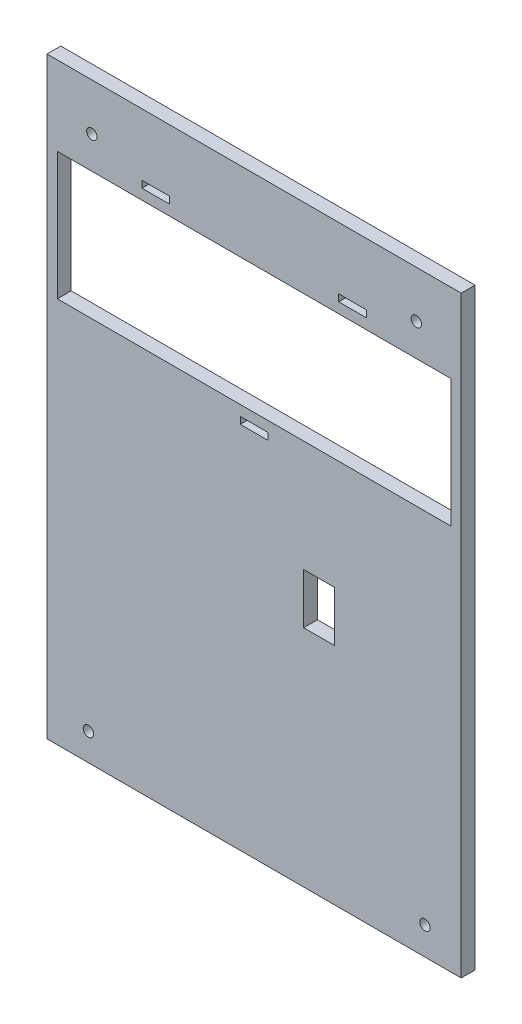
ISO-10303-21;
HEADER;
FILE_DESCRIPTION(('STEP AP214'),'2;1');
FILE_NAME('part.step','',(''),(''),'','','');
FILE_SCHEMA(('AUTOMOTIVE_DESIGN { 1 0 10303 214 1 1 1 1 }'));
ENDSEC;
DATA;
#1=APPLICATION_CONTEXT('core data for automotive mechanical design processes');
#2=APPLICATION_PROTOCOL_DEFINITION('international standard','automotive_design',2000,#1);
#3=PRODUCT_CONTEXT('',#1,'mechanical');
#4=PRODUCT('Part','Part','',(#3));
#5=PRODUCT_RELATED_PRODUCT_CATEGORY('part','',(#4));
#6=PRODUCT_DEFINITION_FORMATION('','',#4);
#7=PRODUCT_DEFINITION_CONTEXT('part definition',#1,'design');
#8=PRODUCT_DEFINITION('design','',#6,#7);
#9=PRODUCT_DEFINITION_SHAPE('','',#8);
#10=(LENGTH_UNIT() NAMED_UNIT(*) SI_UNIT(.MILLI.,.METRE.));
#11=(NAMED_UNIT(*) PLANE_ANGLE_UNIT() SI_UNIT($,.RADIAN.));
#12=(NAMED_UNIT(*) SI_UNIT($,.STERADIAN.) SOLID_ANGLE_UNIT());
#13=UNCERTAINTY_MEASURE_WITH_UNIT(LENGTH_MEASURE(1.E-05),#10,'distance_accuracy_value','');
#14=(GEOMETRIC_REPRESENTATION_CONTEXT(3) GLOBAL_UNCERTAINTY_ASSIGNED_CONTEXT((#13)) GLOBAL_UNIT_ASSIGNED_CONTEXT((#10,
#11,#12)) REPRESENTATION_CONTEXT('',''));
#15=CARTESIAN_POINT('',(0.,0.,0.));
#16=DIRECTION('',(0.,0.,1.));
#17=DIRECTION('',(1.,0.,0.));
#18=AXIS2_PLACEMENT_3D('',#15,#16,#17);
#19=CARTESIAN_POINT('',(0.,0.,4.));
#20=DIRECTION('',(0.,0.,-1.));
#21=DIRECTION('',(-1.,0.,0.));
#22=AXIS2_PLACEMENT_3D('',#19,#20,#21);
#23=PLANE('',#22);
#24=DIRECTION('',(1.,0.,0.));
#25=VECTOR('',#24,1.);
#26=CARTESIAN_POINT('',(74.3565857137862,71.7261271974463,4.));
#27=LINE('',#26,#25);
#28=CARTESIAN_POINT('',(74.3565857137862,71.7261271974463,4.));
#29=VERTEX_POINT('',#28);
#30=CARTESIAN_POINT('',(83.3565857137861,71.7261271974463,4.));
#31=VERTEX_POINT('',#30);
#32=EDGE_CURVE('E362',#29,#31,#27,.T.);
#33=ORIENTED_EDGE('',*,*,#32,.T.);
#34=DIRECTION('',(0.,-1.,0.));
#35=VECTOR('',#34,1.);
#36=CARTESIAN_POINT('',(83.3565857137861,57.1261271974464,4.));
#37=LINE('',#36,#35);
#38=CARTESIAN_POINT('',(83.3565857137861,57.1261271974464,4.));
#39=VERTEX_POINT('',#38);
#40=EDGE_CURVE('E356',#31,#39,#37,.T.);
#41=ORIENTED_EDGE('',*,*,#40,.T.);
#42=DIRECTION('',(-1.,0.,0.));
#43=VECTOR('',#42,1.);
#44=CARTESIAN_POINT('',(74.3565857137862,57.1261271974464,4.));
#45=LINE('',#44,#43);
#46=CARTESIAN_POINT('',(74.3565857137862,57.1261271974464,4.));
#47=VERTEX_POINT('',#46);
#48=EDGE_CURVE('E365',#39,#47,#45,.T.);
#49=ORIENTED_EDGE('',*,*,#48,.T.);
#50=DIRECTION('',(0.,1.,0.));
#51=VECTOR('',#50,1.);
#52=CARTESIAN_POINT('',(74.3565857137862,57.1261271974464,4.));
#53=LINE('',#52,#51);
#54=EDGE_CURVE('E209',#47,#29,#53,.T.);
#55=ORIENTED_EDGE('',*,*,#54,.T.);
#56=EDGE_LOOP('',(#33,#41,#49,#55));
#57=FACE_BOUND('',#56,.T.);
#58=DIRECTION('',(-1.,0.,0.));
#59=VECTOR('',#58,1.);
#60=CARTESIAN_POINT('',(64.,98.97,4.));
#61=LINE('',#60,#59);
#62=CARTESIAN_POINT('',(64.,98.97,4.));
#63=VERTEX_POINT('',#62);
#64=CARTESIAN_POINT('',(56.,98.97,4.));
#65=VERTEX_POINT('',#64);
#66=EDGE_CURVE('E400',#63,#65,#61,.T.);
#67=ORIENTED_EDGE('',*,*,#66,.T.);
#68=DIRECTION('',(0.,1.,0.));
#69=VECTOR('',#68,1.);
#70=CARTESIAN_POINT('',(56.,98.97,4.));
#71=LINE('',#70,#69);
#72=CARTESIAN_POINT('',(56.,100.97,4.));
#73=VERTEX_POINT('',#72);
#74=EDGE_CURVE('E390',#65,#73,#71,.T.);
#75=ORIENTED_EDGE('',*,*,#74,.T.);
#76=DIRECTION('',(1.,0.,0.));
#77=VECTOR('',#76,1.);
#78=CARTESIAN_POINT('',(56.,100.97,4.));
#79=LINE('',#78,#77);
#80=CARTESIAN_POINT('',(64.,100.97,4.));
#81=VERTEX_POINT('',#80);
#82=EDGE_CURVE('E393',#73,#81,#79,.T.);
#83=ORIENTED_EDGE('',*,*,#82,.T.);
#84=DIRECTION('',(0.,-1.,0.));
#85=VECTOR('',#84,1.);
#86=CARTESIAN_POINT('',(64.,100.97,4.));
#87=LINE('',#86,#85);
#88=EDGE_CURVE('E397',#81,#63,#87,.T.);
#89=ORIENTED_EDGE('',*,*,#88,.T.);
#90=EDGE_LOOP('',(#67,#75,#83,#89));
#91=FACE_BOUND('',#90,.T.);
#92=CARTESIAN_POINT('',(12.,0.,4.));
#93=DIRECTION('',(0.,0.,1.));
#94=DIRECTION('',(1.,0.,0.));
#95=AXIS2_PLACEMENT_3D('',#92,#93,#94);
#96=CIRCLE('',#95,1.5);
#97=CARTESIAN_POINT('',(13.5,0.,4.));
#98=VERTEX_POINT('',#97);
#99=EDGE_CURVE('E485',#98,#98,#96,.T.);
#100=ORIENTED_EDGE('',*,*,#99,.F.);
#101=EDGE_LOOP('',(#100));
#102=FACE_BOUND('',#101,.T.);
#103=CARTESIAN_POINT('',(109.5,0.156854249492381,4.));
#104=DIRECTION('',(0.,0.,1.));
#105=DIRECTION('',(1.,0.,0.));
#106=AXIS2_PLACEMENT_3D('',#103,#104,#105);
#107=CIRCLE('',#106,1.5);
#108=CARTESIAN_POINT('',(111.,0.156854249492381,4.));
#109=VERTEX_POINT('',#108);
#110=EDGE_CURVE('E491',#109,#109,#107,.T.);
#111=ORIENTED_EDGE('',*,*,#110,.F.);
#112=EDGE_LOOP('',(#111));
#113=FACE_BOUND('',#112,.T.);
#114=CARTESIAN_POINT('',(107.,150.313145750508,4.));
#115=DIRECTION('',(0.,0.,1.));
#116=DIRECTION('',(1.,0.,0.));
#117=AXIS2_PLACEMENT_3D('',#114,#115,#116);
#118=CIRCLE('',#117,1.50000000000001);
#119=CARTESIAN_POINT('',(108.5,150.313145750508,4.));
#120=VERTEX_POINT('',#119);
#121=EDGE_CURVE('E497',#120,#120,#118,.T.);
#122=ORIENTED_EDGE('',*,*,#121,.F.);
#123=EDGE_LOOP('',(#122));
#124=FACE_BOUND('',#123,.T.);
#125=CARTESIAN_POINT('',(13.,150.313145750508,4.));
#126=DIRECTION('',(0.,0.,1.));
#127=DIRECTION('',(1.,0.,0.));
#128=AXIS2_PLACEMENT_3D('',#125,#126,#127);
#129=CIRCLE('',#128,1.5);
#130=CARTESIAN_POINT('',(14.5,150.313145750508,4.));
#131=VERTEX_POINT('',#130);
#132=EDGE_CURVE('E503',#131,#131,#129,.T.);
#133=ORIENTED_EDGE('',*,*,#132,.F.);
#134=EDGE_LOOP('',(#133));
#135=FACE_BOUND('',#134,.T.);
#136=DIRECTION('',(0.,-1.,0.));
#137=VECTOR('',#136,1.);
#138=CARTESIAN_POINT('',(3.,0.,4.));
#139=LINE('',#138,#137);
#140=CARTESIAN_POINT('',(3.,140.97,4.));
#141=VERTEX_POINT('',#140);
#142=CARTESIAN_POINT('',(3.,103.97,4.));
#143=VERTEX_POINT('',#142);
#144=EDGE_CURVE('E509',#141,#143,#139,.T.);
#145=ORIENTED_EDGE('',*,*,#144,.F.);
#146=DIRECTION('',(1.,0.,0.));
#147=VECTOR('',#146,1.);
#148=CARTESIAN_POINT('',(0.,140.97,4.));
#149=LINE('',#148,#147);
#150=CARTESIAN_POINT('',(117.,140.97,4.));
#151=VERTEX_POINT('',#150);
#152=EDGE_CURVE('E517',#141,#151,#149,.T.);
#153=ORIENTED_EDGE('',*,*,#152,.T.);
#154=DIRECTION('',(0.,-1.,0.));
#155=VECTOR('',#154,1.);
#156=CARTESIAN_POINT('',(117.,0.,4.));
#157=LINE('',#156,#155);
#158=CARTESIAN_POINT('',(117.,103.97,4.));
#159=VERTEX_POINT('',#158);
#160=EDGE_CURVE('E514',#151,#159,#157,.T.);
#161=ORIENTED_EDGE('',*,*,#160,.T.);
#162=DIRECTION('',(1.,0.,0.));
#163=VECTOR('',#162,1.);
#164=CARTESIAN_POINT('',(0.,103.97,4.));
#165=LINE('',#164,#163);
#166=EDGE_CURVE('E511',#143,#159,#165,.T.);
#167=ORIENTED_EDGE('',*,*,#166,.F.);
#168=EDGE_LOOP('',(#145,#153,#161,#167));
#169=FACE_BOUND('',#168,.T.);
#170=DIRECTION('',(0.,1.,0.));
#171=VECTOR('',#170,1.);
#172=CARTESIAN_POINT('',(0.,-7.92893218813452,4.));
#173=LINE('',#172,#171);
#174=CARTESIAN_POINT('',(0.,-7.92893218813452,4.));
#175=VERTEX_POINT('',#174);
#176=CARTESIAN_POINT('',(0.,163.898932188134,4.));
#177=VERTEX_POINT('',#176);
#178=EDGE_CURVE('E541',#175,#177,#173,.T.);
#179=ORIENTED_EDGE('',*,*,#178,.F.);
#180=DIRECTION('',(-1.,0.,0.));
#181=VECTOR('',#180,1.);
#182=CARTESIAN_POINT('',(120.,-7.92893218813451,4.));
#183=LINE('',#182,#181);
#184=CARTESIAN_POINT('',(120.,-7.92893218813451,4.));
#185=VERTEX_POINT('',#184);
#186=EDGE_CURVE('E551',#185,#175,#183,.T.);
#187=ORIENTED_EDGE('',*,*,#186,.F.);
#188=DIRECTION('',(0.,-1.,0.));
#189=VECTOR('',#188,1.);
#190=CARTESIAN_POINT('',(120.,163.898932188134,4.));
#191=LINE('',#190,#189);
#192=CARTESIAN_POINT('',(120.,163.898932188134,4.));
#193=VERTEX_POINT('',#192);
#194=EDGE_CURVE('E548',#193,#185,#191,.T.);
#195=ORIENTED_EDGE('',*,*,#194,.F.);
#196=DIRECTION('',(1.,0.,0.));
#197=VECTOR('',#196,1.);
#198=CARTESIAN_POINT('',(0.,163.898932188134,4.));
#199=LINE('',#198,#197);
#200=EDGE_CURVE('E544',#177,#193,#199,.T.);
#201=ORIENTED_EDGE('',*,*,#200,.F.);
#202=EDGE_LOOP('',(#179,#187,#195,#201));
#203=FACE_BOUND('',#202,.T.);
#204=DIRECTION('',(0.,-1.,0.));
#205=VECTOR('',#204,1.);
#206=CARTESIAN_POINT('',(35.5,0.,4.));
#207=LINE('',#206,#205);
#208=CARTESIAN_POINT('',(35.5,145.97,4.));
#209=VERTEX_POINT('',#208);
#210=CARTESIAN_POINT('',(35.5,143.97,4.));
#211=VERTEX_POINT('',#210);
#212=EDGE_CURVE('E456',#209,#211,#207,.T.);
#213=ORIENTED_EDGE('',*,*,#212,.T.);
#214=DIRECTION('',(-1.,0.,0.));
#215=VECTOR('',#214,1.);
#216=CARTESIAN_POINT('',(0.,143.97,4.));
#217=LINE('',#216,#215);
#218=CARTESIAN_POINT('',(27.5,143.97,4.));
#219=VERTEX_POINT('',#218);
#220=EDGE_CURVE('E453',#211,#219,#217,.T.);
#221=ORIENTED_EDGE('',*,*,#220,.T.);
#222=DIRECTION('',(0.,1.,0.));
#223=VECTOR('',#222,1.);
#224=CARTESIAN_POINT('',(27.5,0.,4.));
#225=LINE('',#224,#223);
#226=CARTESIAN_POINT('',(27.5,145.97,4.));
#227=VERTEX_POINT('',#226);
#228=EDGE_CURVE('E463',#219,#227,#225,.T.);
#229=ORIENTED_EDGE('',*,*,#228,.T.);
#230=DIRECTION('',(1.,0.,0.));
#231=VECTOR('',#230,1.);
#232=CARTESIAN_POINT('',(0.,145.97,4.));
#233=LINE('',#232,#231);
#234=EDGE_CURVE('E460',#227,#209,#233,.T.);
#235=ORIENTED_EDGE('',*,*,#234,.T.);
#236=EDGE_LOOP('',(#213,#221,#229,#235));
#237=FACE_BOUND('',#236,.T.);
#238=DIRECTION('',(0.,-1.,0.));
#239=VECTOR('',#238,1.);
#240=CARTESIAN_POINT('',(84.5,0.,4.));
#241=LINE('',#240,#239);
#242=CARTESIAN_POINT('',(84.5,145.97,4.));
#243=VERTEX_POINT('',#242);
#244=CARTESIAN_POINT('',(84.5,143.97,4.));
#245=VERTEX_POINT('',#244);
#246=EDGE_CURVE('E422',#243,#245,#241,.T.);
#247=ORIENTED_EDGE('',*,*,#246,.F.);
#248=DIRECTION('',(-1.,0.,0.));
#249=VECTOR('',#248,1.);
#250=CARTESIAN_POINT('',(0.,145.97,4.));
#251=LINE('',#250,#249);
#252=CARTESIAN_POINT('',(92.5,145.97,4.));
#253=VERTEX_POINT('',#252);
#254=EDGE_CURVE('E430',#253,#243,#251,.T.);
#255=ORIENTED_EDGE('',*,*,#254,.F.);
#256=DIRECTION('',(0.,1.,0.));
#257=VECTOR('',#256,1.);
#258=CARTESIAN_POINT('',(92.5,0.,4.));
#259=LINE('',#258,#257);
#260=CARTESIAN_POINT('',(92.5,143.97,4.));
#261=VERTEX_POINT('',#260);
#262=EDGE_CURVE('E427',#261,#253,#259,.T.);
#263=ORIENTED_EDGE('',*,*,#262,.F.);
#264=DIRECTION('',(1.,0.,0.));
#265=VECTOR('',#264,1.);
#266=CARTESIAN_POINT('',(0.,143.97,4.));
#267=LINE('',#266,#265);
#268=EDGE_CURVE('E424',#245,#261,#267,.T.);
#269=ORIENTED_EDGE('',*,*,#268,.F.);
#270=EDGE_LOOP('',(#247,#255,#263,#269));
#271=FACE_BOUND('',#270,.T.);
#272=ADVANCED_FACE('F192',(#57,#91,#102,#113,#124,#135,#169,#203,#237,#271),#23,.F.);
#273=CARTESIAN_POINT('',(0.,0.,0.));
#274=DIRECTION('',(0.,0.,-1.));
#275=DIRECTION('',(-1.,0.,0.));
#276=AXIS2_PLACEMENT_3D('',#273,#274,#275);
#277=PLANE('',#276);
#278=DIRECTION('',(0.,-1.,0.));
#279=VECTOR('',#278,1.);
#280=CARTESIAN_POINT('',(83.3565857137861,57.1261271974464,0.));
#281=LINE('',#280,#279);
#282=CARTESIAN_POINT('',(83.3565857137861,71.7261271974463,0.));
#283=VERTEX_POINT('',#282);
#284=CARTESIAN_POINT('',(83.3565857137861,57.1261271974464,0.));
#285=VERTEX_POINT('',#284);
#286=EDGE_CURVE('E217',#283,#285,#281,.T.);
#287=ORIENTED_EDGE('',*,*,#286,.F.);
#288=DIRECTION('',(1.,0.,0.));
#289=VECTOR('',#288,1.);
#290=CARTESIAN_POINT('',(74.3565857137862,71.7261271974463,0.));
#291=LINE('',#290,#289);
#292=CARTESIAN_POINT('',(74.3565857137862,71.7261271974463,0.));
#293=VERTEX_POINT('',#292);
#294=EDGE_CURVE('E371',#293,#283,#291,.T.);
#295=ORIENTED_EDGE('',*,*,#294,.F.);
#296=DIRECTION('',(0.,1.,0.));
#297=VECTOR('',#296,1.);
#298=CARTESIAN_POINT('',(74.3565857137862,57.1261271974464,0.));
#299=LINE('',#298,#297);
#300=CARTESIAN_POINT('',(74.3565857137862,57.1261271974464,0.));
#301=VERTEX_POINT('',#300);
#302=EDGE_CURVE('E374',#301,#293,#299,.T.);
#303=ORIENTED_EDGE('',*,*,#302,.F.);
#304=DIRECTION('',(-1.,0.,0.));
#305=VECTOR('',#304,1.);
#306=CARTESIAN_POINT('',(74.3565857137862,57.1261271974464,0.));
#307=LINE('',#306,#305);
#308=EDGE_CURVE('E380',#285,#301,#307,.T.);
#309=ORIENTED_EDGE('',*,*,#308,.F.);
#310=EDGE_LOOP('',(#287,#295,#303,#309));
#311=FACE_BOUND('',#310,.T.);
#312=DIRECTION('',(0.,1.,0.));
#313=VECTOR('',#312,1.);
#314=CARTESIAN_POINT('',(56.,98.97,0.));
#315=LINE('',#314,#313);
#316=CARTESIAN_POINT('',(56.,98.97,0.));
#317=VERTEX_POINT('',#316);
#318=CARTESIAN_POINT('',(56.,100.97,0.));
#319=VERTEX_POINT('',#318);
#320=EDGE_CURVE('E386',#317,#319,#315,.T.);
#321=ORIENTED_EDGE('',*,*,#320,.F.);
#322=DIRECTION('',(-1.,0.,0.));
#323=VECTOR('',#322,1.);
#324=CARTESIAN_POINT('',(60.,98.97,0.));
#325=LINE('',#324,#323);
#326=CARTESIAN_POINT('',(64.,98.97,0.));
#327=VERTEX_POINT('',#326);
#328=EDGE_CURVE('E394',#327,#317,#325,.T.);
#329=ORIENTED_EDGE('',*,*,#328,.F.);
#330=DIRECTION('',(0.,-1.,0.));
#331=VECTOR('',#330,1.);
#332=CARTESIAN_POINT('',(64.,100.97,0.));
#333=LINE('',#332,#331);
#334=CARTESIAN_POINT('',(64.,100.97,0.));
#335=VERTEX_POINT('',#334);
#336=EDGE_CURVE('E408',#335,#327,#333,.T.);
#337=ORIENTED_EDGE('',*,*,#336,.F.);
#338=DIRECTION('',(1.,0.,0.));
#339=VECTOR('',#338,1.);
#340=CARTESIAN_POINT('',(56.,100.97,0.));
#341=LINE('',#340,#339);
#342=EDGE_CURVE('E405',#319,#335,#341,.T.);
#343=ORIENTED_EDGE('',*,*,#342,.F.);
#344=EDGE_LOOP('',(#321,#329,#337,#343));
#345=FACE_BOUND('',#344,.T.);
#346=DIRECTION('',(-1.,0.,0.));
#347=VECTOR('',#346,1.);
#348=CARTESIAN_POINT('',(0.,143.97,0.));
#349=LINE('',#348,#347);
#350=CARTESIAN_POINT('',(35.5,143.97,0.));
#351=VERTEX_POINT('',#350);
#352=CARTESIAN_POINT('',(27.5,143.97,0.));
#353=VERTEX_POINT('',#352);
#354=EDGE_CURVE('E452',#351,#353,#349,.T.);
#355=ORIENTED_EDGE('',*,*,#354,.F.);
#356=DIRECTION('',(0.,-1.,0.));
#357=VECTOR('',#356,1.);
#358=CARTESIAN_POINT('',(35.5,0.,0.));
#359=LINE('',#358,#357);
#360=CARTESIAN_POINT('',(35.5,145.97,0.));
#361=VERTEX_POINT('',#360);
#362=EDGE_CURVE('E468',#361,#351,#359,.T.);
#363=ORIENTED_EDGE('',*,*,#362,.F.);
#364=DIRECTION('',(1.,0.,0.));
#365=VECTOR('',#364,1.);
#366=CARTESIAN_POINT('',(0.,145.97,0.));
#367=LINE('',#366,#365);
#368=CARTESIAN_POINT('',(27.5,145.97,0.));
#369=VERTEX_POINT('',#368);
#370=EDGE_CURVE('E471',#369,#361,#367,.T.);
#371=ORIENTED_EDGE('',*,*,#370,.F.);
#372=DIRECTION('',(0.,1.,0.));
#373=VECTOR('',#372,1.);
#374=CARTESIAN_POINT('',(27.5,0.,0.));
#375=LINE('',#374,#373);
#376=EDGE_CURVE('E457',#353,#369,#375,.T.);
#377=ORIENTED_EDGE('',*,*,#376,.F.);
#378=EDGE_LOOP('',(#355,#363,#371,#377));
#379=FACE_BOUND('',#378,.T.);
#380=CARTESIAN_POINT('',(109.5,0.156854249492381,0.));
#381=DIRECTION('',(0.,0.,1.));
#382=DIRECTION('',(1.,0.,0.));
#383=AXIS2_PLACEMENT_3D('',#380,#381,#382);
#384=CIRCLE('',#383,1.5);
#385=CARTESIAN_POINT('',(111.,0.156854249492381,0.));
#386=VERTEX_POINT('',#385);
#387=EDGE_CURVE('E488',#386,#386,#384,.T.);
#388=ORIENTED_EDGE('',*,*,#387,.T.);
#389=EDGE_LOOP('',(#388));
#390=FACE_BOUND('',#389,.T.);
#391=CARTESIAN_POINT('',(13.,150.313145750508,0.));
#392=DIRECTION('',(0.,0.,1.));
#393=DIRECTION('',(1.,0.,0.));
#394=AXIS2_PLACEMENT_3D('',#391,#392,#393);
#395=CIRCLE('',#394,1.5);
#396=CARTESIAN_POINT('',(14.5,150.313145750508,0.));
#397=VERTEX_POINT('',#396);
#398=EDGE_CURVE('E500',#397,#397,#395,.T.);
#399=ORIENTED_EDGE('',*,*,#398,.T.);
#400=EDGE_LOOP('',(#399));
#401=FACE_BOUND('',#400,.T.);
#402=DIRECTION('',(0.,1.,0.));
#403=VECTOR('',#402,1.);
#404=CARTESIAN_POINT('',(0.,-7.92893218813452,0.));
#405=LINE('',#404,#403);
#406=CARTESIAN_POINT('',(0.,-7.92893218813452,0.));
#407=VERTEX_POINT('',#406);
#408=CARTESIAN_POINT('',(0.,163.898932188134,0.));
#409=VERTEX_POINT('',#408);
#410=EDGE_CURVE('E540',#407,#409,#405,.T.);
#411=ORIENTED_EDGE('',*,*,#410,.T.);
#412=DIRECTION('',(1.,0.,0.));
#413=VECTOR('',#412,1.);
#414=CARTESIAN_POINT('',(0.,163.898932188134,0.));
#415=LINE('',#414,#413);
#416=CARTESIAN_POINT('',(120.,163.898932188134,0.));
#417=VERTEX_POINT('',#416);
#418=EDGE_CURVE('E556',#409,#417,#415,.T.);
#419=ORIENTED_EDGE('',*,*,#418,.T.);
#420=DIRECTION('',(0.,-1.,0.));
#421=VECTOR('',#420,1.);
#422=CARTESIAN_POINT('',(120.,163.898932188134,0.));
#423=LINE('',#422,#421);
#424=CARTESIAN_POINT('',(120.,-7.92893218813451,0.));
#425=VERTEX_POINT('',#424);
#426=EDGE_CURVE('E559',#417,#425,#423,.T.);
#427=ORIENTED_EDGE('',*,*,#426,.T.);
#428=DIRECTION('',(-1.,0.,0.));
#429=VECTOR('',#428,1.);
#430=CARTESIAN_POINT('',(120.,-7.92893218813451,0.));
#431=LINE('',#430,#429);
#432=EDGE_CURVE('E545',#425,#407,#431,.T.);
#433=ORIENTED_EDGE('',*,*,#432,.T.);
#434=EDGE_LOOP('',(#411,#419,#427,#433));
#435=FACE_BOUND('',#434,.T.);
#436=DIRECTION('',(1.,0.,0.));
#437=VECTOR('',#436,1.);
#438=CARTESIAN_POINT('',(0.,140.97,0.));
#439=LINE('',#438,#437);
#440=CARTESIAN_POINT('',(3.,140.97,0.));
#441=VERTEX_POINT('',#440);
#442=CARTESIAN_POINT('',(117.,140.97,0.));
#443=VERTEX_POINT('',#442);
#444=EDGE_CURVE('E512',#441,#443,#439,.T.);
#445=ORIENTED_EDGE('',*,*,#444,.F.);
#446=DIRECTION('',(0.,-1.,0.));
#447=VECTOR('',#446,1.);
#448=CARTESIAN_POINT('',(3.,0.,0.));
#449=LINE('',#448,#447);
#450=CARTESIAN_POINT('',(3.,103.97,0.));
#451=VERTEX_POINT('',#450);
#452=EDGE_CURVE('E506',#441,#451,#449,.T.);
#453=ORIENTED_EDGE('',*,*,#452,.T.);
#454=DIRECTION('',(1.,0.,0.));
#455=VECTOR('',#454,1.);
#456=CARTESIAN_POINT('',(0.,103.97,0.));
#457=LINE('',#456,#455);
#458=CARTESIAN_POINT('',(117.,103.97,0.));
#459=VERTEX_POINT('',#458);
#460=EDGE_CURVE('E523',#451,#459,#457,.T.);
#461=ORIENTED_EDGE('',*,*,#460,.T.);
#462=DIRECTION('',(0.,-1.,0.));
#463=VECTOR('',#462,1.);
#464=CARTESIAN_POINT('',(117.,0.,0.));
#465=LINE('',#464,#463);
#466=EDGE_CURVE('E526',#443,#459,#465,.T.);
#467=ORIENTED_EDGE('',*,*,#466,.F.);
#468=EDGE_LOOP('',(#445,#453,#461,#467));
#469=FACE_BOUND('',#468,.T.);
#470=CARTESIAN_POINT('',(107.,150.313145750508,0.));
#471=DIRECTION('',(0.,0.,1.));
#472=DIRECTION('',(1.,0.,0.));
#473=AXIS2_PLACEMENT_3D('',#470,#471,#472);
#474=CIRCLE('',#473,1.50000000000001);
#475=CARTESIAN_POINT('',(108.5,150.313145750508,0.));
#476=VERTEX_POINT('',#475);
#477=EDGE_CURVE('E494',#476,#476,#474,.T.);
#478=ORIENTED_EDGE('',*,*,#477,.T.);
#479=EDGE_LOOP('',(#478));
#480=FACE_BOUND('',#479,.T.);
#481=CARTESIAN_POINT('',(12.,0.,0.));
#482=DIRECTION('',(0.,0.,1.));
#483=DIRECTION('',(1.,0.,0.));
#484=AXIS2_PLACEMENT_3D('',#481,#482,#483);
#485=CIRCLE('',#484,1.5);
#486=CARTESIAN_POINT('',(13.5,0.,0.));
#487=VERTEX_POINT('',#486);
#488=EDGE_CURVE('E484',#487,#487,#485,.T.);
#489=ORIENTED_EDGE('',*,*,#488,.T.);
#490=EDGE_LOOP('',(#489));
#491=FACE_BOUND('',#490,.T.);
#492=DIRECTION('',(-1.,0.,0.));
#493=VECTOR('',#492,1.);
#494=CARTESIAN_POINT('',(0.,145.97,0.));
#495=LINE('',#494,#493);
#496=CARTESIAN_POINT('',(92.5,145.97,0.));
#497=VERTEX_POINT('',#496);
#498=CARTESIAN_POINT('',(84.5,145.97,0.));
#499=VERTEX_POINT('',#498);
#500=EDGE_CURVE('E425',#497,#499,#495,.T.);
#501=ORIENTED_EDGE('',*,*,#500,.T.);
#502=DIRECTION('',(0.,-1.,0.));
#503=VECTOR('',#502,1.);
#504=CARTESIAN_POINT('',(84.5,0.,0.));
#505=LINE('',#504,#503);
#506=CARTESIAN_POINT('',(84.5,143.97,0.));
#507=VERTEX_POINT('',#506);
#508=EDGE_CURVE('E415',#499,#507,#505,.T.);
#509=ORIENTED_EDGE('',*,*,#508,.T.);
#510=DIRECTION('',(1.,0.,0.));
#511=VECTOR('',#510,1.);
#512=CARTESIAN_POINT('',(0.,143.97,0.));
#513=LINE('',#512,#511);
#514=CARTESIAN_POINT('',(92.5,143.97,0.));
#515=VERTEX_POINT('',#514);
#516=EDGE_CURVE('E435',#507,#515,#513,.T.);
#517=ORIENTED_EDGE('',*,*,#516,.T.);
#518=DIRECTION('',(0.,1.,0.));
#519=VECTOR('',#518,1.);
#520=CARTESIAN_POINT('',(92.5,0.,0.));
#521=LINE('',#520,#519);
#522=EDGE_CURVE('E438',#515,#497,#521,.T.);
#523=ORIENTED_EDGE('',*,*,#522,.T.);
#524=EDGE_LOOP('',(#501,#509,#517,#523));
#525=FACE_BOUND('',#524,.T.);
#526=ADVANCED_FACE('F574',(#311,#345,#379,#390,#401,#435,#469,#480,#491,#525),#277,.T.);
#527=CARTESIAN_POINT('',(0.,-7.92893218813452,4.));
#528=DIRECTION('',(-1.,0.,0.));
#529=DIRECTION('',(0.,0.,1.));
#530=AXIS2_PLACEMENT_3D('',#527,#528,#529);
#531=PLANE('',#530);
#532=ORIENTED_EDGE('',*,*,#410,.F.);
#533=DIRECTION('',(0.,0.,-1.));
#534=VECTOR('',#533,1.);
#535=CARTESIAN_POINT('',(0.,-7.92893218813452,4.));
#536=LINE('',#535,#534);
#537=EDGE_CURVE('E12',#175,#407,#536,.T.);
#538=ORIENTED_EDGE('',*,*,#537,.F.);
#539=ORIENTED_EDGE('',*,*,#178,.T.);
#540=DIRECTION('',(0.,0.,-1.));
#541=VECTOR('',#540,1.);
#542=CARTESIAN_POINT('',(0.,163.898932188134,4.));
#543=LINE('',#542,#541);
#544=EDGE_CURVE('E196',#177,#409,#543,.T.);
#545=ORIENTED_EDGE('',*,*,#544,.T.);
#546=EDGE_LOOP('',(#532,#538,#539,#545));
#547=FACE_BOUND('',#546,.T.);
#548=ADVANCED_FACE('F194',(#547),#531,.T.);
#549=CARTESIAN_POINT('',(120.,-7.92893218813451,4.));
#550=DIRECTION('',(0.,-1.,0.));
#551=DIRECTION('',(1.,0.,0.));
#552=AXIS2_PLACEMENT_3D('',#549,#550,#551);
#553=PLANE('',#552);
#554=ORIENTED_EDGE('',*,*,#432,.F.);
#555=DIRECTION('',(0.,0.,-1.));
#556=VECTOR('',#555,1.);
#557=CARTESIAN_POINT('',(120.,-7.92893218813451,4.));
#558=LINE('',#557,#556);
#559=EDGE_CURVE('E201',#185,#425,#558,.T.);
#560=ORIENTED_EDGE('',*,*,#559,.F.);
#561=ORIENTED_EDGE('',*,*,#186,.T.);
#562=ORIENTED_EDGE('',*,*,#537,.T.);
#563=EDGE_LOOP('',(#554,#560,#561,#562));
#564=FACE_BOUND('',#563,.T.);
#565=ADVANCED_FACE('F578',(#564),#553,.T.);
#566=CARTESIAN_POINT('',(120.,163.898932188134,4.));
#567=DIRECTION('',(1.,0.,0.));
#568=DIRECTION('',(0.,1.,0.));
#569=AXIS2_PLACEMENT_3D('',#566,#567,#568);
#570=PLANE('',#569);
#571=ORIENTED_EDGE('',*,*,#426,.F.);
#572=DIRECTION('',(0.,0.,-1.));
#573=VECTOR('',#572,1.);
#574=CARTESIAN_POINT('',(120.,163.898932188134,4.));
#575=LINE('',#574,#573);
#576=EDGE_CURVE('E564',#193,#417,#575,.T.);
#577=ORIENTED_EDGE('',*,*,#576,.F.);
#578=ORIENTED_EDGE('',*,*,#194,.T.);
#579=ORIENTED_EDGE('',*,*,#559,.T.);
#580=EDGE_LOOP('',(#571,#577,#578,#579));
#581=FACE_BOUND('',#580,.T.);
#582=ADVANCED_FACE('F584',(#581),#570,.T.);
#583=CARTESIAN_POINT('',(0.,163.898932188134,4.));
#584=DIRECTION('',(0.,1.,0.));
#585=DIRECTION('',(0.,0.,1.));
#586=AXIS2_PLACEMENT_3D('',#583,#584,#585);
#587=PLANE('',#586);
#588=ORIENTED_EDGE('',*,*,#418,.F.);
#589=ORIENTED_EDGE('',*,*,#544,.F.);
#590=ORIENTED_EDGE('',*,*,#200,.T.);
#591=ORIENTED_EDGE('',*,*,#576,.T.);
#592=EDGE_LOOP('',(#588,#589,#590,#591));
#593=FACE_BOUND('',#592,.T.);
#594=ADVANCED_FACE('F572',(#593),#587,.T.);
#595=CARTESIAN_POINT('',(3.,0.,4.));
#596=DIRECTION('',(1.,0.,0.));
#597=DIRECTION('',(0.,0.,-1.));
#598=AXIS2_PLACEMENT_3D('',#595,#596,#597);
#599=PLANE('',#598);
#600=ORIENTED_EDGE('',*,*,#452,.F.);
#601=DIRECTION('',(0.,0.,-1.));
#602=VECTOR('',#601,1.);
#603=CARTESIAN_POINT('',(3.,140.97,4.));
#604=LINE('',#603,#602);
#605=EDGE_CURVE('E520',#141,#441,#604,.T.);
#606=ORIENTED_EDGE('',*,*,#605,.F.);
#607=ORIENTED_EDGE('',*,*,#144,.T.);
#608=DIRECTION('',(0.,0.,-1.));
#609=VECTOR('',#608,1.);
#610=CARTESIAN_POINT('',(3.,103.97,4.));
#611=LINE('',#610,#609);
#612=EDGE_CURVE('E537',#143,#451,#611,.T.);
#613=ORIENTED_EDGE('',*,*,#612,.T.);
#614=EDGE_LOOP('',(#600,#606,#607,#613));
#615=FACE_BOUND('',#614,.T.);
#616=ADVANCED_FACE('F591',(#615),#599,.T.);
#617=CARTESIAN_POINT('',(0.,103.97,4.));
#618=DIRECTION('',(0.,1.,0.));
#619=DIRECTION('',(-1.,0.,0.));
#620=AXIS2_PLACEMENT_3D('',#617,#618,#619);
#621=PLANE('',#620);
#622=ORIENTED_EDGE('',*,*,#460,.F.);
#623=ORIENTED_EDGE('',*,*,#612,.F.);
#624=ORIENTED_EDGE('',*,*,#166,.T.);
#625=DIRECTION('',(0.,0.,-1.));
#626=VECTOR('',#625,1.);
#627=CARTESIAN_POINT('',(117.,103.97,4.));
#628=LINE('',#627,#626);
#629=EDGE_CURVE('E535',#159,#459,#628,.T.);
#630=ORIENTED_EDGE('',*,*,#629,.T.);
#631=EDGE_LOOP('',(#622,#623,#624,#630));
#632=FACE_BOUND('',#631,.T.);
#633=ADVANCED_FACE('F603',(#632),#621,.T.);
#634=CARTESIAN_POINT('',(117.,0.,4.));
#635=DIRECTION('',(1.,0.,0.));
#636=DIRECTION('',(0.,0.,-1.));
#637=AXIS2_PLACEMENT_3D('',#634,#635,#636);
#638=PLANE('',#637);
#639=ORIENTED_EDGE('',*,*,#466,.T.);
#640=ORIENTED_EDGE('',*,*,#629,.F.);
#641=ORIENTED_EDGE('',*,*,#160,.F.);
#642=DIRECTION('',(0.,0.,-1.));
#643=VECTOR('',#642,1.);
#644=CARTESIAN_POINT('',(117.,140.97,4.));
#645=LINE('',#644,#643);
#646=EDGE_CURVE('E533',#151,#443,#645,.T.);
#647=ORIENTED_EDGE('',*,*,#646,.T.);
#648=EDGE_LOOP('',(#639,#640,#641,#647));
#649=FACE_BOUND('',#648,.T.);
#650=ADVANCED_FACE('F607',(#649),#638,.F.);
#651=CARTESIAN_POINT('',(0.,140.97,4.));
#652=DIRECTION('',(0.,1.,0.));
#653=DIRECTION('',(0.,0.,1.));
#654=AXIS2_PLACEMENT_3D('',#651,#652,#653);
#655=PLANE('',#654);
#656=ORIENTED_EDGE('',*,*,#444,.T.);
#657=ORIENTED_EDGE('',*,*,#646,.F.);
#658=ORIENTED_EDGE('',*,*,#152,.F.);
#659=ORIENTED_EDGE('',*,*,#605,.T.);
#660=EDGE_LOOP('',(#656,#657,#658,#659));
#661=FACE_BOUND('',#660,.T.);
#662=ADVANCED_FACE('F611',(#661),#655,.F.);
#663=CARTESIAN_POINT('',(13.,150.313145750508,4.));
#664=DIRECTION('',(0.,0.,-1.));
#665=DIRECTION('',(-1.,0.,0.));
#666=AXIS2_PLACEMENT_3D('',#663,#664,#665);
#667=CYLINDRICAL_SURFACE('',#666,1.5);
#668=ORIENTED_EDGE('',*,*,#132,.T.);
#669=EDGE_LOOP('',(#668));
#670=FACE_BOUND('',#669,.T.);
#671=ORIENTED_EDGE('',*,*,#398,.F.);
#672=EDGE_LOOP('',(#671));
#673=FACE_BOUND('',#672,.T.);
#674=ADVANCED_FACE('F615',(#670,#673),#667,.F.);
#675=CARTESIAN_POINT('',(107.,150.313145750508,4.));
#676=DIRECTION('',(0.,0.,-1.));
#677=DIRECTION('',(-1.,0.,0.));
#678=AXIS2_PLACEMENT_3D('',#675,#676,#677);
#679=CYLINDRICAL_SURFACE('',#678,1.50000000000001);
#680=ORIENTED_EDGE('',*,*,#121,.T.);
#681=EDGE_LOOP('',(#680));
#682=FACE_BOUND('',#681,.T.);
#683=ORIENTED_EDGE('',*,*,#477,.F.);
#684=EDGE_LOOP('',(#683));
#685=FACE_BOUND('',#684,.T.);
#686=ADVANCED_FACE('F619',(#682,#685),#679,.F.);
#687=CARTESIAN_POINT('',(109.5,0.156854249492381,4.));
#688=DIRECTION('',(0.,0.,-1.));
#689=DIRECTION('',(-1.,0.,0.));
#690=AXIS2_PLACEMENT_3D('',#687,#688,#689);
#691=CYLINDRICAL_SURFACE('',#690,1.5);
#692=ORIENTED_EDGE('',*,*,#110,.T.);
#693=EDGE_LOOP('',(#692));
#694=FACE_BOUND('',#693,.T.);
#695=ORIENTED_EDGE('',*,*,#387,.F.);
#696=EDGE_LOOP('',(#695));
#697=FACE_BOUND('',#696,.T.);
#698=ADVANCED_FACE('F623',(#694,#697),#691,.F.);
#699=CARTESIAN_POINT('',(12.,0.,4.));
#700=DIRECTION('',(0.,0.,-1.));
#701=DIRECTION('',(-1.,0.,0.));
#702=AXIS2_PLACEMENT_3D('',#699,#700,#701);
#703=CYLINDRICAL_SURFACE('',#702,1.5);
#704=ORIENTED_EDGE('',*,*,#99,.T.);
#705=EDGE_LOOP('',(#704));
#706=FACE_BOUND('',#705,.T.);
#707=ORIENTED_EDGE('',*,*,#488,.F.);
#708=EDGE_LOOP('',(#707));
#709=FACE_BOUND('',#708,.T.);
#710=ADVANCED_FACE('F627',(#706,#709),#703,.F.);
#711=CARTESIAN_POINT('',(0.,143.97,4.));
#712=DIRECTION('',(0.,-1.,0.));
#713=DIRECTION('',(0.,0.,-1.));
#714=AXIS2_PLACEMENT_3D('',#711,#712,#713);
#715=PLANE('',#714);
#716=ORIENTED_EDGE('',*,*,#354,.T.);
#717=DIRECTION('',(0.,0.,-1.));
#718=VECTOR('',#717,1.);
#719=CARTESIAN_POINT('',(27.5,143.97,4.));
#720=LINE('',#719,#718);
#721=EDGE_CURVE('E466',#219,#353,#720,.T.);
#722=ORIENTED_EDGE('',*,*,#721,.F.);
#723=ORIENTED_EDGE('',*,*,#220,.F.);
#724=DIRECTION('',(0.,0.,-1.));
#725=VECTOR('',#724,1.);
#726=CARTESIAN_POINT('',(35.5,143.97,4.));
#727=LINE('',#726,#725);
#728=EDGE_CURVE('E482',#211,#351,#727,.T.);
#729=ORIENTED_EDGE('',*,*,#728,.T.);
#730=EDGE_LOOP('',(#716,#722,#723,#729));
#731=FACE_BOUND('',#730,.T.);
#732=ADVANCED_FACE('F631',(#731),#715,.F.);
#733=CARTESIAN_POINT('',(35.5,0.,4.));
#734=DIRECTION('',(1.,0.,0.));
#735=DIRECTION('',(0.,0.,-1.));
#736=AXIS2_PLACEMENT_3D('',#733,#734,#735);
#737=PLANE('',#736);
#738=ORIENTED_EDGE('',*,*,#362,.T.);
#739=ORIENTED_EDGE('',*,*,#728,.F.);
#740=ORIENTED_EDGE('',*,*,#212,.F.);
#741=DIRECTION('',(0.,0.,-1.));
#742=VECTOR('',#741,1.);
#743=CARTESIAN_POINT('',(35.5,145.97,4.));
#744=LINE('',#743,#742);
#745=EDGE_CURVE('E480',#209,#361,#744,.T.);
#746=ORIENTED_EDGE('',*,*,#745,.T.);
#747=EDGE_LOOP('',(#738,#739,#740,#746));
#748=FACE_BOUND('',#747,.T.);
#749=ADVANCED_FACE('F635',(#748),#737,.F.);
#750=CARTESIAN_POINT('',(0.,145.97,4.));
#751=DIRECTION('',(0.,1.,0.));
#752=DIRECTION('',(0.,0.,1.));
#753=AXIS2_PLACEMENT_3D('',#750,#751,#752);
#754=PLANE('',#753);
#755=ORIENTED_EDGE('',*,*,#370,.T.);
#756=ORIENTED_EDGE('',*,*,#745,.F.);
#757=ORIENTED_EDGE('',*,*,#234,.F.);
#758=DIRECTION('',(0.,0.,-1.));
#759=VECTOR('',#758,1.);
#760=CARTESIAN_POINT('',(27.5,145.97,4.));
#761=LINE('',#760,#759);
#762=EDGE_CURVE('E478',#227,#369,#761,.T.);
#763=ORIENTED_EDGE('',*,*,#762,.T.);
#764=EDGE_LOOP('',(#755,#756,#757,#763));
#765=FACE_BOUND('',#764,.T.);
#766=ADVANCED_FACE('F639',(#765),#754,.F.);
#767=CARTESIAN_POINT('',(27.5,0.,4.));
#768=DIRECTION('',(-1.,0.,0.));
#769=DIRECTION('',(0.,0.,1.));
#770=AXIS2_PLACEMENT_3D('',#767,#768,#769);
#771=PLANE('',#770);
#772=ORIENTED_EDGE('',*,*,#376,.T.);
#773=ORIENTED_EDGE('',*,*,#762,.F.);
#774=ORIENTED_EDGE('',*,*,#228,.F.);
#775=ORIENTED_EDGE('',*,*,#721,.T.);
#776=EDGE_LOOP('',(#772,#773,#774,#775));
#777=FACE_BOUND('',#776,.T.);
#778=ADVANCED_FACE('F643',(#777),#771,.F.);
#779=CARTESIAN_POINT('',(84.5,0.,4.));
#780=DIRECTION('',(1.,0.,0.));
#781=DIRECTION('',(0.,0.,-1.));
#782=AXIS2_PLACEMENT_3D('',#779,#780,#781);
#783=PLANE('',#782);
#784=ORIENTED_EDGE('',*,*,#508,.F.);
#785=DIRECTION('',(0.,0.,-1.));
#786=VECTOR('',#785,1.);
#787=CARTESIAN_POINT('',(84.5,145.97,4.));
#788=LINE('',#787,#786);
#789=EDGE_CURVE('E432',#243,#499,#788,.T.);
#790=ORIENTED_EDGE('',*,*,#789,.F.);
#791=ORIENTED_EDGE('',*,*,#246,.T.);
#792=DIRECTION('',(0.,0.,-1.));
#793=VECTOR('',#792,1.);
#794=CARTESIAN_POINT('',(84.5,143.97,4.));
#795=LINE('',#794,#793);
#796=EDGE_CURVE('E449',#245,#507,#795,.T.);
#797=ORIENTED_EDGE('',*,*,#796,.T.);
#798=EDGE_LOOP('',(#784,#790,#791,#797));
#799=FACE_BOUND('',#798,.T.);
#800=ADVANCED_FACE('F647',(#799),#783,.T.);
#801=CARTESIAN_POINT('',(0.,143.97,4.));
#802=DIRECTION('',(0.,1.,0.));
#803=DIRECTION('',(0.,0.,1.));
#804=AXIS2_PLACEMENT_3D('',#801,#802,#803);
#805=PLANE('',#804);
#806=ORIENTED_EDGE('',*,*,#516,.F.);
#807=ORIENTED_EDGE('',*,*,#796,.F.);
#808=ORIENTED_EDGE('',*,*,#268,.T.);
#809=DIRECTION('',(0.,0.,-1.));
#810=VECTOR('',#809,1.);
#811=CARTESIAN_POINT('',(92.5,143.97,4.));
#812=LINE('',#811,#810);
#813=EDGE_CURVE('E447',#261,#515,#812,.T.);
#814=ORIENTED_EDGE('',*,*,#813,.T.);
#815=EDGE_LOOP('',(#806,#807,#808,#814));
#816=FACE_BOUND('',#815,.T.);
#817=ADVANCED_FACE('F651',(#816),#805,.T.);
#818=CARTESIAN_POINT('',(92.5,0.,4.));
#819=DIRECTION('',(-1.,0.,0.));
#820=DIRECTION('',(0.,0.,1.));
#821=AXIS2_PLACEMENT_3D('',#818,#819,#820);
#822=PLANE('',#821);
#823=ORIENTED_EDGE('',*,*,#522,.F.);
#824=ORIENTED_EDGE('',*,*,#813,.F.);
#825=ORIENTED_EDGE('',*,*,#262,.T.);
#826=DIRECTION('',(0.,0.,-1.));
#827=VECTOR('',#826,1.);
#828=CARTESIAN_POINT('',(92.5,145.97,4.));
#829=LINE('',#828,#827);
#830=EDGE_CURVE('E445',#253,#497,#829,.T.);
#831=ORIENTED_EDGE('',*,*,#830,.T.);
#832=EDGE_LOOP('',(#823,#824,#825,#831));
#833=FACE_BOUND('',#832,.T.);
#834=ADVANCED_FACE('F655',(#833),#822,.T.);
#835=CARTESIAN_POINT('',(0.,145.97,4.));
#836=DIRECTION('',(0.,-1.,0.));
#837=DIRECTION('',(0.,0.,-1.));
#838=AXIS2_PLACEMENT_3D('',#835,#836,#837);
#839=PLANE('',#838);
#840=ORIENTED_EDGE('',*,*,#500,.F.);
#841=ORIENTED_EDGE('',*,*,#830,.F.);
#842=ORIENTED_EDGE('',*,*,#254,.T.);
#843=ORIENTED_EDGE('',*,*,#789,.T.);
#844=EDGE_LOOP('',(#840,#841,#842,#843));
#845=FACE_BOUND('',#844,.T.);
#846=ADVANCED_FACE('F659',(#845),#839,.T.);
#847=CARTESIAN_POINT('',(56.,98.97,4.));
#848=DIRECTION('',(-1.,0.,0.));
#849=DIRECTION('',(0.,0.,1.));
#850=AXIS2_PLACEMENT_3D('',#847,#848,#849);
#851=PLANE('',#850);
#852=ORIENTED_EDGE('',*,*,#320,.T.);
#853=DIRECTION('',(0.,0.,-1.));
#854=VECTOR('',#853,1.);
#855=CARTESIAN_POINT('',(56.,100.97,4.));
#856=LINE('',#855,#854);
#857=EDGE_CURVE('E403',#73,#319,#856,.T.);
#858=ORIENTED_EDGE('',*,*,#857,.F.);
#859=ORIENTED_EDGE('',*,*,#74,.F.);
#860=DIRECTION('',(0.,0.,-1.));
#861=VECTOR('',#860,1.);
#862=CARTESIAN_POINT('',(56.,98.97,4.));
#863=LINE('',#862,#861);
#864=EDGE_CURVE('E413',#65,#317,#863,.T.);
#865=ORIENTED_EDGE('',*,*,#864,.T.);
#866=EDGE_LOOP('',(#852,#858,#859,#865));
#867=FACE_BOUND('',#866,.T.);
#868=ADVANCED_FACE('F663',(#867),#851,.F.);
#869=CARTESIAN_POINT('',(60.,98.97,4.));
#870=DIRECTION('',(0.,-1.,0.));
#871=DIRECTION('',(1.,0.,0.));
#872=AXIS2_PLACEMENT_3D('',#869,#870,#871);
#873=PLANE('',#872);
#874=ORIENTED_EDGE('',*,*,#328,.T.);
#875=ORIENTED_EDGE('',*,*,#864,.F.);
#876=ORIENTED_EDGE('',*,*,#66,.F.);
#877=DIRECTION('',(0.,0.,-1.));
#878=VECTOR('',#877,1.);
#879=CARTESIAN_POINT('',(64.,98.97,4.));
#880=LINE('',#879,#878);
#881=EDGE_CURVE('E416',#63,#327,#880,.T.);
#882=ORIENTED_EDGE('',*,*,#881,.T.);
#883=EDGE_LOOP('',(#874,#875,#876,#882));
#884=FACE_BOUND('',#883,.T.);
#885=ADVANCED_FACE('F667',(#884),#873,.F.);
#886=CARTESIAN_POINT('',(64.,100.97,4.));
#887=DIRECTION('',(1.,0.,0.));
#888=DIRECTION('',(0.,0.,-1.));
#889=AXIS2_PLACEMENT_3D('',#886,#887,#888);
#890=PLANE('',#889);
#891=ORIENTED_EDGE('',*,*,#336,.T.);
#892=ORIENTED_EDGE('',*,*,#881,.F.);
#893=ORIENTED_EDGE('',*,*,#88,.F.);
#894=DIRECTION('',(0.,0.,-1.));
#895=VECTOR('',#894,1.);
#896=CARTESIAN_POINT('',(64.,100.97,4.));
#897=LINE('',#896,#895);
#898=EDGE_CURVE('E418',#81,#335,#897,.T.);
#899=ORIENTED_EDGE('',*,*,#898,.T.);
#900=EDGE_LOOP('',(#891,#892,#893,#899));
#901=FACE_BOUND('',#900,.T.);
#902=ADVANCED_FACE('F672',(#901),#890,.F.);
#903=CARTESIAN_POINT('',(56.,100.97,4.));
#904=DIRECTION('',(0.,1.,0.));
#905=DIRECTION('',(0.,0.,1.));
#906=AXIS2_PLACEMENT_3D('',#903,#904,#905);
#907=PLANE('',#906);
#908=ORIENTED_EDGE('',*,*,#342,.T.);
#909=ORIENTED_EDGE('',*,*,#898,.F.);
#910=ORIENTED_EDGE('',*,*,#82,.F.);
#911=ORIENTED_EDGE('',*,*,#857,.T.);
#912=EDGE_LOOP('',(#908,#909,#910,#911));
#913=FACE_BOUND('',#912,.T.);
#914=ADVANCED_FACE('F669',(#913),#907,.F.);
#915=CARTESIAN_POINT('',(83.3565857137861,57.1261271974464,4.));
#916=DIRECTION('',(1.,0.,0.));
#917=DIRECTION('',(0.,0.,-1.));
#918=AXIS2_PLACEMENT_3D('',#915,#916,#917);
#919=PLANE('',#918);
#920=ORIENTED_EDGE('',*,*,#286,.T.);
#921=DIRECTION('',(0.,0.,-1.));
#922=VECTOR('',#921,1.);
#923=CARTESIAN_POINT('',(83.3565857137861,57.1261271974464,4.));
#924=LINE('',#923,#922);
#925=EDGE_CURVE('E352',#39,#285,#924,.T.);
#926=ORIENTED_EDGE('',*,*,#925,.F.);
#927=ORIENTED_EDGE('',*,*,#40,.F.);
#928=DIRECTION('',(0.,0.,-1.));
#929=VECTOR('',#928,1.);
#930=CARTESIAN_POINT('',(83.3565857137861,71.7261271974463,4.));
#931=LINE('',#930,#929);
#932=EDGE_CURVE('E384',#31,#283,#931,.T.);
#933=ORIENTED_EDGE('',*,*,#932,.T.);
#934=EDGE_LOOP('',(#920,#926,#927,#933));
#935=FACE_BOUND('',#934,.T.);
#936=ADVANCED_FACE('F354',(#935),#919,.F.);
#937=CARTESIAN_POINT('',(74.3565857137862,71.7261271974463,4.));
#938=DIRECTION('',(0.,1.,0.));
#939=DIRECTION('',(0.,0.,1.));
#940=AXIS2_PLACEMENT_3D('',#937,#938,#939);
#941=PLANE('',#940);
#942=ORIENTED_EDGE('',*,*,#294,.T.);
#943=ORIENTED_EDGE('',*,*,#932,.F.);
#944=ORIENTED_EDGE('',*,*,#32,.F.);
#945=DIRECTION('',(0.,0.,-1.));
#946=VECTOR('',#945,1.);
#947=CARTESIAN_POINT('',(74.3565857137862,71.7261271974463,4.));
#948=LINE('',#947,#946);
#949=EDGE_CURVE('E387',#29,#293,#948,.T.);
#950=ORIENTED_EDGE('',*,*,#949,.T.);
#951=EDGE_LOOP('',(#942,#943,#944,#950));
#952=FACE_BOUND('',#951,.T.);
#953=ADVANCED_FACE('F682',(#952),#941,.F.);
#954=CARTESIAN_POINT('',(74.3565857137862,57.1261271974464,4.));
#955=DIRECTION('',(-1.,0.,0.));
#956=DIRECTION('',(0.,0.,1.));
#957=AXIS2_PLACEMENT_3D('',#954,#955,#956);
#958=PLANE('',#957);
#959=ORIENTED_EDGE('',*,*,#302,.T.);
#960=ORIENTED_EDGE('',*,*,#949,.F.);
#961=ORIENTED_EDGE('',*,*,#54,.F.);
#962=DIRECTION('',(0.,0.,-1.));
#963=VECTOR('',#962,1.);
#964=CARTESIAN_POINT('',(74.3565857137862,57.1261271974464,4.));
#965=LINE('',#964,#963);
#966=EDGE_CURVE('E361',#47,#301,#965,.T.);
#967=ORIENTED_EDGE('',*,*,#966,.T.);
#968=EDGE_LOOP('',(#959,#960,#961,#967));
#969=FACE_BOUND('',#968,.T.);
#970=ADVANCED_FACE('F685',(#969),#958,.F.);
#971=CARTESIAN_POINT('',(74.3565857137862,57.1261271974464,4.));
#972=DIRECTION('',(0.,-1.,0.));
#973=DIRECTION('',(0.,0.,-1.));
#974=AXIS2_PLACEMENT_3D('',#971,#972,#973);
#975=PLANE('',#974);
#976=ORIENTED_EDGE('',*,*,#308,.T.);
#977=ORIENTED_EDGE('',*,*,#966,.F.);
#978=ORIENTED_EDGE('',*,*,#48,.F.);
#979=ORIENTED_EDGE('',*,*,#925,.T.);
#980=EDGE_LOOP('',(#976,#977,#978,#979));
#981=FACE_BOUND('',#980,.T.);
#982=ADVANCED_FACE('F366',(#981),#975,.F.);
#983=CLOSED_SHELL('',(#272,#526,#548,#565,#582,#594,#616,#633,#650,#662,#674,#686,#698,#710,
#732,#749,#766,#778,#800,#817,#834,#846,#868,#885,#902,#914,#936,#953,#970,#982));
#984=MANIFOLD_SOLID_BREP('B2',#983);
#985=ADVANCED_BREP_SHAPE_REPRESENTATION('',(#18,#984),#14);
#986=SHAPE_DEFINITION_REPRESENTATION(#9,#985);
ENDSEC;
END-ISO-10303-21;
